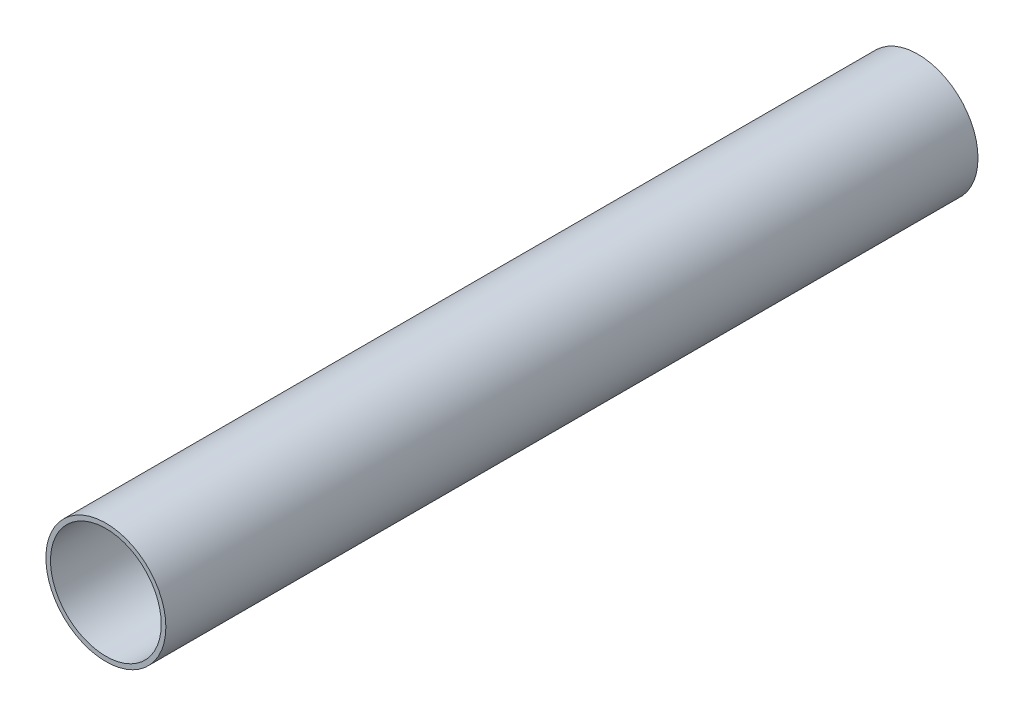
ISO-10303-21;
HEADER;
FILE_DESCRIPTION(('STEP AP214'),'2;1');
FILE_NAME('part.step','',(''),(''),'','','');
FILE_SCHEMA(('AUTOMOTIVE_DESIGN { 1 0 10303 214 1 1 1 1 }'));
ENDSEC;
DATA;
#1=APPLICATION_CONTEXT('core data for automotive mechanical design processes');
#2=APPLICATION_PROTOCOL_DEFINITION('international standard','automotive_design',2000,#1);
#3=PRODUCT_CONTEXT('',#1,'mechanical');
#4=PRODUCT('Part','Part','',(#3));
#5=PRODUCT_RELATED_PRODUCT_CATEGORY('part','',(#4));
#6=PRODUCT_DEFINITION_FORMATION('','',#4);
#7=PRODUCT_DEFINITION_CONTEXT('part definition',#1,'design');
#8=PRODUCT_DEFINITION('design','',#6,#7);
#9=PRODUCT_DEFINITION_SHAPE('','',#8);
#10=(LENGTH_UNIT() NAMED_UNIT(*) SI_UNIT(.MILLI.,.METRE.));
#11=(NAMED_UNIT(*) PLANE_ANGLE_UNIT() SI_UNIT($,.RADIAN.));
#12=(NAMED_UNIT(*) SI_UNIT($,.STERADIAN.) SOLID_ANGLE_UNIT());
#13=UNCERTAINTY_MEASURE_WITH_UNIT(LENGTH_MEASURE(1.E-05),#10,'distance_accuracy_value','');
#14=(GEOMETRIC_REPRESENTATION_CONTEXT(3) GLOBAL_UNCERTAINTY_ASSIGNED_CONTEXT((#13)) GLOBAL_UNIT_ASSIGNED_CONTEXT((#10,
#11,#12)) REPRESENTATION_CONTEXT('',''));
#15=CARTESIAN_POINT('',(0.,0.,0.));
#16=DIRECTION('',(0.,0.,1.));
#17=DIRECTION('',(1.,0.,0.));
#18=AXIS2_PLACEMENT_3D('',#15,#16,#17);
#19=CARTESIAN_POINT('',(0.,0.,279.4));
#20=DIRECTION('',(0.,0.,1.));
#21=DIRECTION('',(1.,0.,0.));
#22=AXIS2_PLACEMENT_3D('',#19,#20,#21);
#23=PLANE('',#22);
#24=CARTESIAN_POINT('',(0.,0.,279.4));
#25=DIRECTION('',(0.,0.,1.));
#26=DIRECTION('',(1.,0.,0.));
#27=AXIS2_PLACEMENT_3D('',#24,#25,#26);
#28=CIRCLE('',#27,20.6375);
#29=CARTESIAN_POINT('',(20.6375,0.,279.4));
#30=VERTEX_POINT('',#29);
#31=EDGE_CURVE('E10',#30,#30,#28,.T.);
#32=ORIENTED_EDGE('',*,*,#31,.T.);
#33=EDGE_LOOP('',(#32));
#34=FACE_BOUND('',#33,.T.);
#35=CARTESIAN_POINT('',(0.,0.,279.4));
#36=DIRECTION('',(0.,0.,1.));
#37=DIRECTION('',(1.,0.,0.));
#38=AXIS2_PLACEMENT_3D('',#35,#36,#37);
#39=CIRCLE('',#38,19.05);
#40=CARTESIAN_POINT('',(19.05,0.,279.4));
#41=VERTEX_POINT('',#40);
#42=EDGE_CURVE('E50',#41,#41,#39,.T.);
#43=ORIENTED_EDGE('',*,*,#42,.F.);
#44=EDGE_LOOP('',(#43));
#45=FACE_BOUND('',#44,.T.);
#46=ADVANCED_FACE('F37',(#34,#45),#23,.T.);
#47=CARTESIAN_POINT('',(0.,0.,0.));
#48=DIRECTION('',(0.,0.,1.));
#49=DIRECTION('',(1.,0.,0.));
#50=AXIS2_PLACEMENT_3D('',#47,#48,#49);
#51=PLANE('',#50);
#52=CARTESIAN_POINT('',(0.,0.,0.));
#53=DIRECTION('',(0.,0.,1.));
#54=DIRECTION('',(1.,0.,0.));
#55=AXIS2_PLACEMENT_3D('',#52,#53,#54);
#56=CIRCLE('',#55,20.6375);
#57=CARTESIAN_POINT('',(20.6375,0.,0.));
#58=VERTEX_POINT('',#57);
#59=EDGE_CURVE('E41',#58,#58,#56,.T.);
#60=ORIENTED_EDGE('',*,*,#59,.F.);
#61=EDGE_LOOP('',(#60));
#62=FACE_BOUND('',#61,.T.);
#63=CARTESIAN_POINT('',(0.,0.,0.));
#64=DIRECTION('',(0.,0.,1.));
#65=DIRECTION('',(1.,0.,0.));
#66=AXIS2_PLACEMENT_3D('',#63,#64,#65);
#67=CIRCLE('',#66,19.05);
#68=CARTESIAN_POINT('',(19.05,0.,0.));
#69=VERTEX_POINT('',#68);
#70=EDGE_CURVE('E52',#69,#69,#67,.T.);
#71=ORIENTED_EDGE('',*,*,#70,.T.);
#72=EDGE_LOOP('',(#71));
#73=FACE_BOUND('',#72,.T.);
#74=ADVANCED_FACE('F64',(#62,#73),#51,.F.);
#75=CARTESIAN_POINT('',(0.,0.,279.4));
#76=DIRECTION('',(0.,0.,-1.));
#77=DIRECTION('',(-1.,0.,0.));
#78=AXIS2_PLACEMENT_3D('',#75,#76,#77);
#79=CYLINDRICAL_SURFACE('',#78,20.6375);
#80=ORIENTED_EDGE('',*,*,#31,.F.);
#81=EDGE_LOOP('',(#80));
#82=FACE_BOUND('',#81,.T.);
#83=ORIENTED_EDGE('',*,*,#59,.T.);
#84=EDGE_LOOP('',(#83));
#85=FACE_BOUND('',#84,.T.);
#86=ADVANCED_FACE('F39',(#82,#85),#79,.T.);
#87=CARTESIAN_POINT('',(0.,0.,279.4));
#88=DIRECTION('',(0.,0.,-1.));
#89=DIRECTION('',(-1.,0.,0.));
#90=AXIS2_PLACEMENT_3D('',#87,#88,#89);
#91=CYLINDRICAL_SURFACE('',#90,19.05);
#92=ORIENTED_EDGE('',*,*,#42,.T.);
#93=EDGE_LOOP('',(#92));
#94=FACE_BOUND('',#93,.T.);
#95=ORIENTED_EDGE('',*,*,#70,.F.);
#96=EDGE_LOOP('',(#95));
#97=FACE_BOUND('',#96,.T.);
#98=ADVANCED_FACE('F60',(#94,#97),#91,.F.);
#99=CLOSED_SHELL('',(#46,#74,#86,#98));
#100=MANIFOLD_SOLID_BREP('B2',#99);
#101=ADVANCED_BREP_SHAPE_REPRESENTATION('',(#18,#100),#14);
#102=SHAPE_DEFINITION_REPRESENTATION(#9,#101);
ENDSEC;
END-ISO-10303-21;
